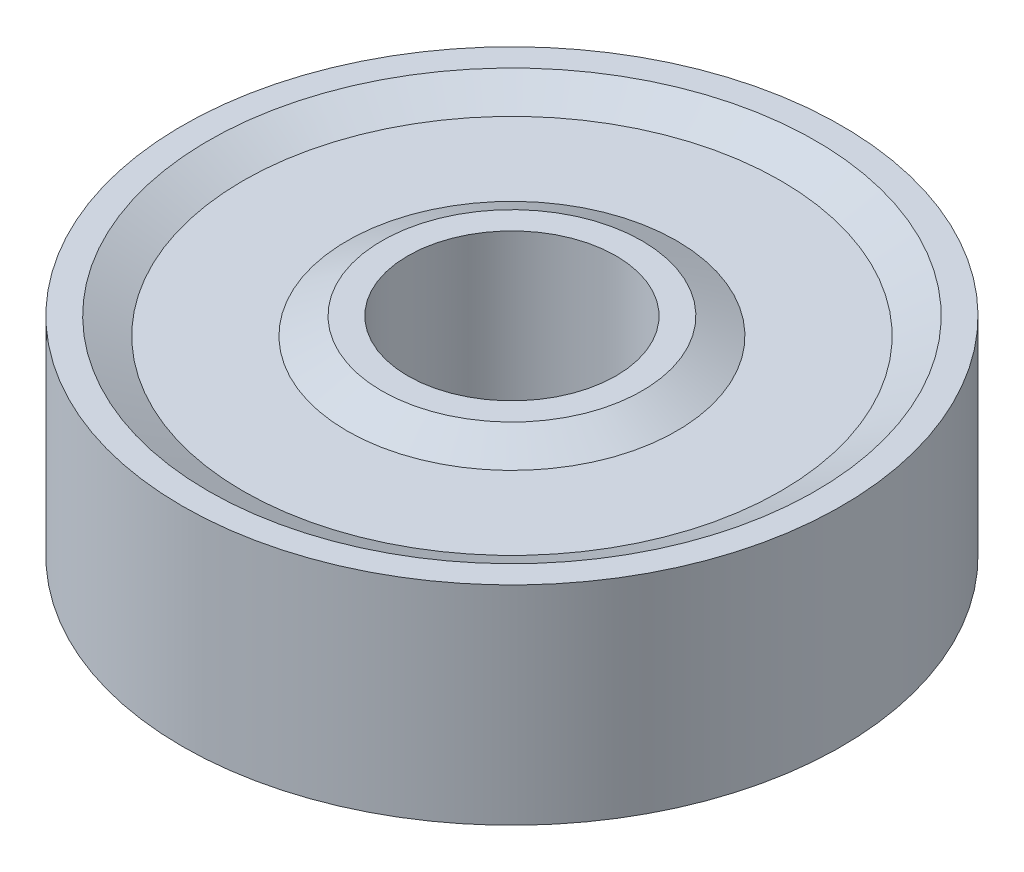
ISO-10303-21;
HEADER;
FILE_DESCRIPTION(('STEP AP214'),'2;1');
FILE_NAME('part.step','',(''),(''),'','','');
FILE_SCHEMA(('AUTOMOTIVE_DESIGN { 1 0 10303 214 1 1 1 1 }'));
ENDSEC;
DATA;
#1=APPLICATION_CONTEXT('core data for automotive mechanical design processes');
#2=APPLICATION_PROTOCOL_DEFINITION('international standard','automotive_design',2000,#1);
#3=PRODUCT_CONTEXT('',#1,'mechanical');
#4=PRODUCT('Part','Part','',(#3));
#5=PRODUCT_RELATED_PRODUCT_CATEGORY('part','',(#4));
#6=PRODUCT_DEFINITION_FORMATION('','',#4);
#7=PRODUCT_DEFINITION_CONTEXT('part definition',#1,'design');
#8=PRODUCT_DEFINITION('design','',#6,#7);
#9=PRODUCT_DEFINITION_SHAPE('','',#8);
#10=(LENGTH_UNIT() NAMED_UNIT(*) SI_UNIT(.MILLI.,.METRE.));
#11=(NAMED_UNIT(*) PLANE_ANGLE_UNIT() SI_UNIT($,.RADIAN.));
#12=(NAMED_UNIT(*) SI_UNIT($,.STERADIAN.) SOLID_ANGLE_UNIT());
#13=UNCERTAINTY_MEASURE_WITH_UNIT(LENGTH_MEASURE(1.E-05),#10,'distance_accuracy_value','');
#14=(GEOMETRIC_REPRESENTATION_CONTEXT(3) GLOBAL_UNCERTAINTY_ASSIGNED_CONTEXT((#13)) GLOBAL_UNIT_ASSIGNED_CONTEXT((#10,
#11,#12)) REPRESENTATION_CONTEXT('',''));
#15=CARTESIAN_POINT('',(0.,0.,0.));
#16=DIRECTION('',(0.,0.,1.));
#17=DIRECTION('',(1.,0.,0.));
#18=AXIS2_PLACEMENT_3D('',#15,#16,#17);
#19=CARTESIAN_POINT('',(0.,0.,0.));
#20=DIRECTION('',(0.,1.,0.));
#21=DIRECTION('',(0.,0.,1.));
#22=AXIS2_PLACEMENT_3D('',#19,#20,#21);
#23=PLANE('',#22);
#24=CARTESIAN_POINT('',(0.,0.,0.));
#25=DIRECTION('',(0.,1.,0.));
#26=DIRECTION('',(0.,0.,1.));
#27=AXIS2_PLACEMENT_3D('',#24,#25,#26);
#28=CIRCLE('',#27,9.5);
#29=CARTESIAN_POINT('',(0.,0.,9.5));
#30=VERTEX_POINT('',#29);
#31=EDGE_CURVE('E35',#30,#30,#28,.T.);
#32=ORIENTED_EDGE('',*,*,#31,.F.);
#33=EDGE_LOOP('',(#32));
#34=FACE_BOUND('',#33,.T.);
#35=CARTESIAN_POINT('',(0.,0.,0.));
#36=DIRECTION('',(0.,1.,0.));
#37=DIRECTION('',(0.,0.,1.));
#38=AXIS2_PLACEMENT_3D('',#35,#36,#37);
#39=CIRCLE('',#38,8.75);
#40=CARTESIAN_POINT('',(0.,0.,8.75));
#41=VERTEX_POINT('',#40);
#42=EDGE_CURVE('E54',#41,#41,#39,.T.);
#43=ORIENTED_EDGE('',*,*,#42,.T.);
#44=EDGE_LOOP('',(#43));
#45=FACE_BOUND('',#44,.T.);
#46=ADVANCED_FACE('F31',(#34,#45),#23,.F.);
#47=CARTESIAN_POINT('',(0.,6.,0.));
#48=DIRECTION('',(0.,1.,0.));
#49=DIRECTION('',(0.,0.,1.));
#50=AXIS2_PLACEMENT_3D('',#47,#48,#49);
#51=PLANE('',#50);
#52=CARTESIAN_POINT('',(0.,6.,0.));
#53=DIRECTION('',(0.,1.,0.));
#54=DIRECTION('',(0.,0.,1.));
#55=AXIS2_PLACEMENT_3D('',#52,#53,#54);
#56=CIRCLE('',#55,8.74999999999999);
#57=CARTESIAN_POINT('',(0.,6.,8.74999999999999));
#58=VERTEX_POINT('',#57);
#59=EDGE_CURVE('E53',#58,#58,#56,.T.);
#60=ORIENTED_EDGE('',*,*,#59,.F.);
#61=EDGE_LOOP('',(#60));
#62=FACE_BOUND('',#61,.T.);
#63=CARTESIAN_POINT('',(0.,6.,0.));
#64=DIRECTION('',(0.,1.,0.));
#65=DIRECTION('',(0.,0.,1.));
#66=AXIS2_PLACEMENT_3D('',#63,#64,#65);
#67=CIRCLE('',#66,9.5);
#68=CARTESIAN_POINT('',(0.,6.,9.5));
#69=VERTEX_POINT('',#68);
#70=EDGE_CURVE('E10',#69,#69,#67,.T.);
#71=ORIENTED_EDGE('',*,*,#70,.T.);
#72=EDGE_LOOP('',(#71));
#73=FACE_BOUND('',#72,.T.);
#74=ADVANCED_FACE('F76',(#62,#73),#51,.T.);
#75=CARTESIAN_POINT('',(0.,6.,0.));
#76=DIRECTION('',(0.,-1.,0.));
#77=DIRECTION('',(0.,0.,-1.));
#78=AXIS2_PLACEMENT_3D('',#75,#76,#77);
#79=CYLINDRICAL_SURFACE('',#78,9.5);
#80=ORIENTED_EDGE('',*,*,#70,.F.);
#81=EDGE_LOOP('',(#80));
#82=FACE_BOUND('',#81,.T.);
#83=ORIENTED_EDGE('',*,*,#31,.T.);
#84=EDGE_LOOP('',(#83));
#85=FACE_BOUND('',#84,.T.);
#86=ADVANCED_FACE('F33',(#82,#85),#79,.T.);
#87=CARTESIAN_POINT('',(-4.75,0.5,0.));
#88=DIRECTION('',(0.,1.,0.));
#89=DIRECTION('',(0.,0.,1.));
#90=AXIS2_PLACEMENT_3D('',#87,#88,#89);
#91=PLANE('',#90);
#92=CARTESIAN_POINT('',(0.,0.5,0.));
#93=DIRECTION('',(0.,1.,0.));
#94=DIRECTION('',(0.,0.,1.));
#95=AXIS2_PLACEMENT_3D('',#92,#93,#94);
#96=CIRCLE('',#95,7.75);
#97=CARTESIAN_POINT('',(0.,0.5,7.75));
#98=VERTEX_POINT('',#97);
#99=EDGE_CURVE('E50',#98,#98,#96,.T.);
#100=ORIENTED_EDGE('',*,*,#99,.F.);
#101=EDGE_LOOP('',(#100));
#102=FACE_BOUND('',#101,.T.);
#103=CARTESIAN_POINT('',(0.,0.5,0.));
#104=DIRECTION('',(0.,1.,0.));
#105=DIRECTION('',(0.,0.,1.));
#106=AXIS2_PLACEMENT_3D('',#103,#104,#105);
#107=CIRCLE('',#106,4.75);
#108=CARTESIAN_POINT('',(0.,0.5,4.75));
#109=VERTEX_POINT('',#108);
#110=EDGE_CURVE('E60',#109,#109,#107,.T.);
#111=ORIENTED_EDGE('',*,*,#110,.T.);
#112=EDGE_LOOP('',(#111));
#113=FACE_BOUND('',#112,.T.);
#114=ADVANCED_FACE('F84',(#102,#113),#91,.F.);
#115=CARTESIAN_POINT('',(0.,0.5,0.));
#116=DIRECTION('',(0.,-1.,0.));
#117=DIRECTION('',(0.,0.,-1.));
#118=AXIS2_PLACEMENT_3D('',#115,#116,#117);
#119=CONICAL_SURFACE('',#118,7.75,1.10714871779409);
#120=ORIENTED_EDGE('',*,*,#42,.F.);
#121=EDGE_LOOP('',(#120));
#122=FACE_BOUND('',#121,.T.);
#123=ORIENTED_EDGE('',*,*,#99,.T.);
#124=EDGE_LOOP('',(#123));
#125=FACE_BOUND('',#124,.T.);
#126=ADVANCED_FACE('F113',(#122,#125),#119,.F.);
#127=CARTESIAN_POINT('',(0.,0.,0.));
#128=DIRECTION('',(0.,1.,0.));
#129=DIRECTION('',(0.,0.,1.));
#130=AXIS2_PLACEMENT_3D('',#127,#128,#129);
#131=CONICAL_SURFACE('',#130,3.75,1.10714871779409);
#132=ORIENTED_EDGE('',*,*,#110,.F.);
#133=EDGE_LOOP('',(#132));
#134=FACE_BOUND('',#133,.T.);
#135=CARTESIAN_POINT('',(0.,0.,0.));
#136=DIRECTION('',(0.,1.,0.));
#137=DIRECTION('',(0.,0.,1.));
#138=AXIS2_PLACEMENT_3D('',#135,#136,#137);
#139=CIRCLE('',#138,3.75);
#140=CARTESIAN_POINT('',(0.,0.,3.75));
#141=VERTEX_POINT('',#140);
#142=EDGE_CURVE('E57',#141,#141,#139,.T.);
#143=ORIENTED_EDGE('',*,*,#142,.T.);
#144=EDGE_LOOP('',(#143));
#145=FACE_BOUND('',#144,.T.);
#146=ADVANCED_FACE('F110',(#134,#145),#131,.T.);
#147=CARTESIAN_POINT('',(0.,5.5,0.));
#148=DIRECTION('',(0.,-1.,0.));
#149=DIRECTION('',(0.,0.,-1.));
#150=AXIS2_PLACEMENT_3D('',#147,#148,#149);
#151=CONICAL_SURFACE('',#150,4.75,1.10714871779409);
#152=CARTESIAN_POINT('',(0.,6.,0.));
#153=DIRECTION('',(0.,1.,0.));
#154=DIRECTION('',(0.,0.,1.));
#155=AXIS2_PLACEMENT_3D('',#152,#153,#154);
#156=CIRCLE('',#155,3.75);
#157=CARTESIAN_POINT('',(0.,6.,3.75));
#158=VERTEX_POINT('',#157);
#159=EDGE_CURVE('E47',#158,#158,#156,.T.);
#160=ORIENTED_EDGE('',*,*,#159,.F.);
#161=EDGE_LOOP('',(#160));
#162=FACE_BOUND('',#161,.T.);
#163=CARTESIAN_POINT('',(0.,5.5,0.));
#164=DIRECTION('',(0.,1.,0.));
#165=DIRECTION('',(0.,0.,1.));
#166=AXIS2_PLACEMENT_3D('',#163,#164,#165);
#167=CIRCLE('',#166,4.75);
#168=CARTESIAN_POINT('',(0.,5.5,4.75));
#169=VERTEX_POINT('',#168);
#170=EDGE_CURVE('E65',#169,#169,#167,.T.);
#171=ORIENTED_EDGE('',*,*,#170,.T.);
#172=EDGE_LOOP('',(#171));
#173=FACE_BOUND('',#172,.T.);
#174=ADVANCED_FACE('F112',(#162,#173),#151,.T.);
#175=CARTESIAN_POINT('',(-4.75,5.5,0.));
#176=DIRECTION('',(0.,-1.,0.));
#177=DIRECTION('',(0.,0.,-1.));
#178=AXIS2_PLACEMENT_3D('',#175,#176,#177);
#179=PLANE('',#178);
#180=ORIENTED_EDGE('',*,*,#170,.F.);
#181=EDGE_LOOP('',(#180));
#182=FACE_BOUND('',#181,.T.);
#183=CARTESIAN_POINT('',(0.,5.5,0.));
#184=DIRECTION('',(0.,1.,0.));
#185=DIRECTION('',(0.,0.,1.));
#186=AXIS2_PLACEMENT_3D('',#183,#184,#185);
#187=CIRCLE('',#186,7.75);
#188=CARTESIAN_POINT('',(0.,5.5,7.75));
#189=VERTEX_POINT('',#188);
#190=EDGE_CURVE('E68',#189,#189,#187,.T.);
#191=ORIENTED_EDGE('',*,*,#190,.T.);
#192=EDGE_LOOP('',(#191));
#193=FACE_BOUND('',#192,.T.);
#194=ADVANCED_FACE('F97',(#182,#193),#179,.F.);
#195=CARTESIAN_POINT('',(0.,6.,0.));
#196=DIRECTION('',(0.,1.,0.));
#197=DIRECTION('',(0.,0.,1.));
#198=AXIS2_PLACEMENT_3D('',#195,#196,#197);
#199=CONICAL_SURFACE('',#198,8.74999999999999,1.10714871779409);
#200=ORIENTED_EDGE('',*,*,#190,.F.);
#201=EDGE_LOOP('',(#200));
#202=FACE_BOUND('',#201,.T.);
#203=ORIENTED_EDGE('',*,*,#59,.T.);
#204=EDGE_LOOP('',(#203));
#205=FACE_BOUND('',#204,.T.);
#206=ADVANCED_FACE('F74',(#202,#205),#199,.F.);
#207=ORIENTED_EDGE('',*,*,#159,.T.);
#208=EDGE_LOOP('',(#207));
#209=FACE_BOUND('',#208,.T.);
#210=CARTESIAN_POINT('',(0.,6.,0.));
#211=DIRECTION('',(0.,1.,0.));
#212=DIRECTION('',(0.,0.,1.));
#213=AXIS2_PLACEMENT_3D('',#210,#211,#212);
#214=CIRCLE('',#213,3.);
#215=CARTESIAN_POINT('',(0.,6.,3.));
#216=VERTEX_POINT('',#215);
#217=EDGE_CURVE('E42',#216,#216,#214,.T.);
#218=ORIENTED_EDGE('',*,*,#217,.F.);
#219=EDGE_LOOP('',(#218));
#220=FACE_BOUND('',#219,.T.);
#221=ADVANCED_FACE('F79',(#209,#220),#51,.T.);
#222=CARTESIAN_POINT('',(0.,6.,0.));
#223=DIRECTION('',(0.,-1.,0.));
#224=DIRECTION('',(0.,0.,-1.));
#225=AXIS2_PLACEMENT_3D('',#222,#223,#224);
#226=CYLINDRICAL_SURFACE('',#225,3.);
#227=ORIENTED_EDGE('',*,*,#217,.T.);
#228=EDGE_LOOP('',(#227));
#229=FACE_BOUND('',#228,.T.);
#230=CARTESIAN_POINT('',(0.,0.,0.));
#231=DIRECTION('',(0.,1.,0.));
#232=DIRECTION('',(0.,0.,1.));
#233=AXIS2_PLACEMENT_3D('',#230,#231,#232);
#234=CIRCLE('',#233,3.);
#235=CARTESIAN_POINT('',(0.,0.,3.));
#236=VERTEX_POINT('',#235);
#237=EDGE_CURVE('E44',#236,#236,#234,.T.);
#238=ORIENTED_EDGE('',*,*,#237,.F.);
#239=EDGE_LOOP('',(#238));
#240=FACE_BOUND('',#239,.T.);
#241=ADVANCED_FACE('F90',(#229,#240),#226,.F.);
#242=ORIENTED_EDGE('',*,*,#237,.T.);
#243=EDGE_LOOP('',(#242));
#244=FACE_BOUND('',#243,.T.);
#245=ORIENTED_EDGE('',*,*,#142,.F.);
#246=EDGE_LOOP('',(#245));
#247=FACE_BOUND('',#246,.T.);
#248=ADVANCED_FACE('F87',(#244,#247),#23,.F.);
#249=CLOSED_SHELL('',(#46,#74,#86,#114,#126,#146,#174,#194,#206,#221,#241,#248));
#250=MANIFOLD_SOLID_BREP('B2',#249);
#251=ADVANCED_BREP_SHAPE_REPRESENTATION('',(#18,#250),#14);
#252=SHAPE_DEFINITION_REPRESENTATION(#9,#251);
ENDSEC;
END-ISO-10303-21;
